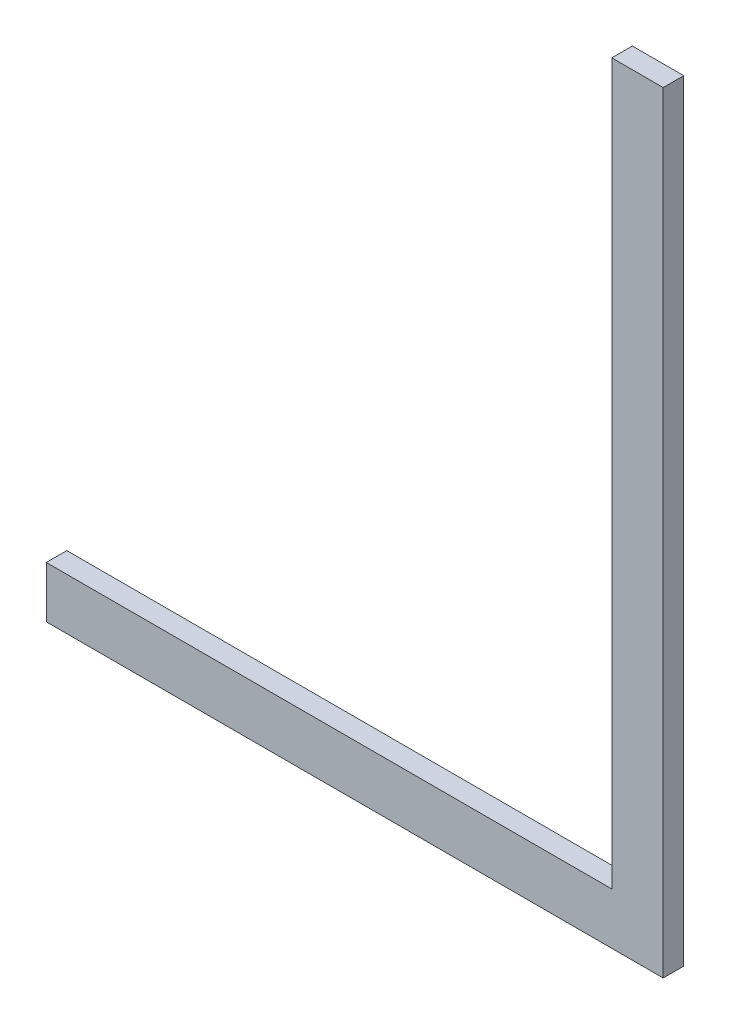
ISO-10303-21;
HEADER;
FILE_DESCRIPTION(('STEP AP214'),'2;1');
FILE_NAME('part.step','',(''),(''),'','','');
FILE_SCHEMA(('AUTOMOTIVE_DESIGN { 1 0 10303 214 1 1 1 1 }'));
ENDSEC;
DATA;
#1=APPLICATION_CONTEXT('core data for automotive mechanical design processes');
#2=APPLICATION_PROTOCOL_DEFINITION('international standard','automotive_design',2000,#1);
#3=PRODUCT_CONTEXT('',#1,'mechanical');
#4=PRODUCT('Part','Part','',(#3));
#5=PRODUCT_RELATED_PRODUCT_CATEGORY('part','',(#4));
#6=PRODUCT_DEFINITION_FORMATION('','',#4);
#7=PRODUCT_DEFINITION_CONTEXT('part definition',#1,'design');
#8=PRODUCT_DEFINITION('design','',#6,#7);
#9=PRODUCT_DEFINITION_SHAPE('','',#8);
#10=(LENGTH_UNIT() NAMED_UNIT(*) SI_UNIT(.MILLI.,.METRE.));
#11=(NAMED_UNIT(*) PLANE_ANGLE_UNIT() SI_UNIT($,.RADIAN.));
#12=(NAMED_UNIT(*) SI_UNIT($,.STERADIAN.) SOLID_ANGLE_UNIT());
#13=UNCERTAINTY_MEASURE_WITH_UNIT(LENGTH_MEASURE(1.E-05),#10,'distance_accuracy_value','');
#14=(GEOMETRIC_REPRESENTATION_CONTEXT(3) GLOBAL_UNCERTAINTY_ASSIGNED_CONTEXT((#13)) GLOBAL_UNIT_ASSIGNED_CONTEXT((#10,
#11,#12)) REPRESENTATION_CONTEXT('',''));
#15=CARTESIAN_POINT('',(0.,0.,0.));
#16=DIRECTION('',(0.,0.,1.));
#17=DIRECTION('',(1.,0.,0.));
#18=AXIS2_PLACEMENT_3D('',#15,#16,#17);
#19=CARTESIAN_POINT('',(-5.87837837837839,145.456081081081,4.));
#20=DIRECTION('',(1.,0.,0.));
#21=DIRECTION('',(0.,1.,0.));
#22=AXIS2_PLACEMENT_3D('',#19,#20,#21);
#23=PLANE('',#22);
#24=DIRECTION('',(0.,-1.,0.));
#25=VECTOR('',#24,1.);
#26=CARTESIAN_POINT('',(-5.87837837837839,145.456081081081,0.));
#27=LINE('',#26,#25);
#28=CARTESIAN_POINT('',(-5.87837837837839,145.456081081081,0.));
#29=VERTEX_POINT('',#28);
#30=CARTESIAN_POINT('',(-5.8783783783784,5.45608108108106,0.));
#31=VERTEX_POINT('',#30);
#32=EDGE_CURVE('E118',#29,#31,#27,.T.);
#33=ORIENTED_EDGE('',*,*,#32,.T.);
#34=DIRECTION('',(0.,0.,1.));
#35=VECTOR('',#34,1.);
#36=CARTESIAN_POINT('',(-5.8783783783784,5.45608108108106,0.));
#37=LINE('',#36,#35);
#38=CARTESIAN_POINT('',(-5.87837837837838,5.45608108108106,4.));
#39=VERTEX_POINT('',#38);
#40=EDGE_CURVE('E103',#31,#39,#37,.T.);
#41=ORIENTED_EDGE('',*,*,#40,.T.);
#42=DIRECTION('',(0.,-1.,0.));
#43=VECTOR('',#42,1.);
#44=CARTESIAN_POINT('',(-5.87837837837839,145.456081081081,4.));
#45=LINE('',#44,#43);
#46=CARTESIAN_POINT('',(-5.87837837837839,145.456081081081,4.));
#47=VERTEX_POINT('',#46);
#48=EDGE_CURVE('E141',#47,#39,#45,.T.);
#49=ORIENTED_EDGE('',*,*,#48,.F.);
#50=DIRECTION('',(0.,0.,-1.));
#51=VECTOR('',#50,1.);
#52=CARTESIAN_POINT('',(-5.87837837837839,145.456081081081,4.));
#53=LINE('',#52,#51);
#54=EDGE_CURVE('E123',#47,#29,#53,.T.);
#55=ORIENTED_EDGE('',*,*,#54,.T.);
#56=EDGE_LOOP('',(#33,#41,#49,#55));
#57=FACE_BOUND('',#56,.T.);
#58=ADVANCED_FACE('F43',(#57),#23,.F.);
#59=CARTESIAN_POINT('',(4.12162162162163,-4.54391891891892,4.));
#60=DIRECTION('',(0.,1.,0.));
#61=DIRECTION('',(-1.,0.,0.));
#62=AXIS2_PLACEMENT_3D('',#59,#60,#61);
#63=PLANE('',#62);
#64=DIRECTION('',(1.,0.,0.));
#65=VECTOR('',#64,1.);
#66=CARTESIAN_POINT('',(4.12162162162163,-4.54391891891892,0.));
#67=LINE('',#66,#65);
#68=CARTESIAN_POINT('',(-115.878378378378,-4.54391891891893,0.));
#69=VERTEX_POINT('',#68);
#70=CARTESIAN_POINT('',(4.12162162162163,-4.54391891891892,0.));
#71=VERTEX_POINT('',#70);
#72=EDGE_CURVE('E125',#69,#71,#67,.T.);
#73=ORIENTED_EDGE('',*,*,#72,.T.);
#74=DIRECTION('',(0.,0.,-1.));
#75=VECTOR('',#74,1.);
#76=CARTESIAN_POINT('',(4.12162162162163,-4.54391891891892,4.));
#77=LINE('',#76,#75);
#78=CARTESIAN_POINT('',(4.12162162162163,-4.54391891891892,4.));
#79=VERTEX_POINT('',#78);
#80=EDGE_CURVE('E11',#79,#71,#77,.T.);
#81=ORIENTED_EDGE('',*,*,#80,.F.);
#82=DIRECTION('',(1.,0.,0.));
#83=VECTOR('',#82,1.);
#84=CARTESIAN_POINT('',(4.12162162162163,-4.54391891891892,4.));
#85=LINE('',#84,#83);
#86=CARTESIAN_POINT('',(-115.878378378378,-4.54391891891893,4.));
#87=VERTEX_POINT('',#86);
#88=EDGE_CURVE('E89',#87,#79,#85,.T.);
#89=ORIENTED_EDGE('',*,*,#88,.F.);
#90=DIRECTION('',(0.,0.,1.));
#91=VECTOR('',#90,1.);
#92=CARTESIAN_POINT('',(-115.878378378378,-4.54391891891893,0.));
#93=LINE('',#92,#91);
#94=EDGE_CURVE('E126',#69,#87,#93,.T.);
#95=ORIENTED_EDGE('',*,*,#94,.F.);
#96=EDGE_LOOP('',(#73,#81,#89,#95));
#97=FACE_BOUND('',#96,.T.);
#98=ADVANCED_FACE('F153',(#97),#63,.F.);
#99=CARTESIAN_POINT('',(4.12162162162161,145.456081081081,4.));
#100=DIRECTION('',(-1.,0.,0.));
#101=DIRECTION('',(0.,-1.,0.));
#102=AXIS2_PLACEMENT_3D('',#99,#100,#101);
#103=PLANE('',#102);
#104=DIRECTION('',(0.,1.,0.));
#105=VECTOR('',#104,1.);
#106=CARTESIAN_POINT('',(4.12162162162161,145.456081081081,0.));
#107=LINE('',#106,#105);
#108=CARTESIAN_POINT('',(4.12162162162161,145.456081081081,0.));
#109=VERTEX_POINT('',#108);
#110=EDGE_CURVE('E130',#71,#109,#107,.T.);
#111=ORIENTED_EDGE('',*,*,#110,.T.);
#112=DIRECTION('',(0.,0.,-1.));
#113=VECTOR('',#112,1.);
#114=CARTESIAN_POINT('',(4.12162162162161,145.456081081081,4.));
#115=LINE('',#114,#113);
#116=CARTESIAN_POINT('',(4.12162162162161,145.456081081081,4.));
#117=VERTEX_POINT('',#116);
#118=EDGE_CURVE('E51',#117,#109,#115,.T.);
#119=ORIENTED_EDGE('',*,*,#118,.F.);
#120=DIRECTION('',(0.,1.,0.));
#121=VECTOR('',#120,1.);
#122=CARTESIAN_POINT('',(4.12162162162161,145.456081081081,4.));
#123=LINE('',#122,#121);
#124=EDGE_CURVE('E151',#79,#117,#123,.T.);
#125=ORIENTED_EDGE('',*,*,#124,.F.);
#126=ORIENTED_EDGE('',*,*,#80,.T.);
#127=EDGE_LOOP('',(#111,#119,#125,#126));
#128=FACE_BOUND('',#127,.T.);
#129=ADVANCED_FACE('F150',(#128),#103,.F.);
#130=CARTESIAN_POINT('',(4.12162162162161,145.456081081081,4.));
#131=DIRECTION('',(0.,-1.,0.));
#132=DIRECTION('',(0.,0.,-1.));
#133=AXIS2_PLACEMENT_3D('',#130,#131,#132);
#134=PLANE('',#133);
#135=DIRECTION('',(-1.,0.,0.));
#136=VECTOR('',#135,1.);
#137=CARTESIAN_POINT('',(4.12162162162161,145.456081081081,0.));
#138=LINE('',#137,#136);
#139=EDGE_CURVE('E84',#109,#29,#138,.T.);
#140=ORIENTED_EDGE('',*,*,#139,.T.);
#141=ORIENTED_EDGE('',*,*,#54,.F.);
#142=DIRECTION('',(-1.,0.,0.));
#143=VECTOR('',#142,1.);
#144=CARTESIAN_POINT('',(4.12162162162161,145.456081081081,4.));
#145=LINE('',#144,#143);
#146=EDGE_CURVE('E67',#117,#47,#145,.T.);
#147=ORIENTED_EDGE('',*,*,#146,.F.);
#148=ORIENTED_EDGE('',*,*,#118,.T.);
#149=EDGE_LOOP('',(#140,#141,#147,#148));
#150=FACE_BOUND('',#149,.T.);
#151=ADVANCED_FACE('F145',(#150),#134,.F.);
#152=CARTESIAN_POINT('',(0.,0.,4.));
#153=DIRECTION('',(0.,0.,-1.));
#154=DIRECTION('',(-1.,0.,0.));
#155=AXIS2_PLACEMENT_3D('',#152,#153,#154);
#156=PLANE('',#155);
#157=ORIENTED_EDGE('',*,*,#48,.T.);
#158=DIRECTION('',(-1.,0.,0.));
#159=VECTOR('',#158,1.);
#160=CARTESIAN_POINT('',(-115.878378378378,5.45608108108107,4.));
#161=LINE('',#160,#159);
#162=CARTESIAN_POINT('',(-115.878378378378,5.45608108108107,4.));
#163=VERTEX_POINT('',#162);
#164=EDGE_CURVE('E58',#39,#163,#161,.T.);
#165=ORIENTED_EDGE('',*,*,#164,.T.);
#166=DIRECTION('',(0.,-1.,0.));
#167=VECTOR('',#166,1.);
#168=CARTESIAN_POINT('',(-115.878378378378,-4.54391891891893,4.));
#169=LINE('',#168,#167);
#170=EDGE_CURVE('E121',#163,#87,#169,.T.);
#171=ORIENTED_EDGE('',*,*,#170,.T.);
#172=ORIENTED_EDGE('',*,*,#88,.T.);
#173=ORIENTED_EDGE('',*,*,#124,.T.);
#174=ORIENTED_EDGE('',*,*,#146,.T.);
#175=EDGE_LOOP('',(#157,#165,#171,#172,#173,#174));
#176=FACE_BOUND('',#175,.T.);
#177=ADVANCED_FACE('F173',(#176),#156,.F.);
#178=CARTESIAN_POINT('',(0.,0.,0.));
#179=DIRECTION('',(0.,0.,-1.));
#180=DIRECTION('',(-1.,0.,0.));
#181=AXIS2_PLACEMENT_3D('',#178,#179,#180);
#182=PLANE('',#181);
#183=CARTESIAN_POINT('',(-0.878378378378394,135.456081081081,0.));
#184=DIRECTION('',(0.,0.,-1.));
#185=DIRECTION('',(-1.,0.,0.));
#186=AXIS2_PLACEMENT_3D('',#183,#184,#185);
#187=CIRCLE('',#186,3.);
#188=CARTESIAN_POINT('',(-3.8783783783784,135.456081081081,0.));
#189=VERTEX_POINT('',#188);
#190=EDGE_CURVE('E289',#189,#189,#187,.T.);
#191=ORIENTED_EDGE('',*,*,#190,.F.);
#192=EDGE_LOOP('',(#191));
#193=FACE_BOUND('',#192,.T.);
#194=ORIENTED_EDGE('',*,*,#32,.F.);
#195=ORIENTED_EDGE('',*,*,#139,.F.);
#196=ORIENTED_EDGE('',*,*,#110,.F.);
#197=ORIENTED_EDGE('',*,*,#72,.F.);
#198=DIRECTION('',(0.,-1.,0.));
#199=VECTOR('',#198,1.);
#200=CARTESIAN_POINT('',(-115.878378378378,-4.54391891891893,0.));
#201=LINE('',#200,#199);
#202=CARTESIAN_POINT('',(-115.878378378378,5.45608108108107,0.));
#203=VERTEX_POINT('',#202);
#204=EDGE_CURVE('E112',#203,#69,#201,.T.);
#205=ORIENTED_EDGE('',*,*,#204,.F.);
#206=DIRECTION('',(-1.,0.,0.));
#207=VECTOR('',#206,1.);
#208=CARTESIAN_POINT('',(-115.878378378378,5.45608108108107,0.));
#209=LINE('',#208,#207);
#210=EDGE_CURVE('E106',#31,#203,#209,.T.);
#211=ORIENTED_EDGE('',*,*,#210,.F.);
#212=EDGE_LOOP('',(#194,#195,#196,#197,#205,#211));
#213=FACE_BOUND('',#212,.T.);
#214=ADVANCED_FACE('F117',(#193,#213),#182,.T.);
#215=CARTESIAN_POINT('',(-115.878378378378,-4.54391891891893,0.));
#216=DIRECTION('',(-1.,0.,0.));
#217=DIRECTION('',(0.,0.,1.));
#218=AXIS2_PLACEMENT_3D('',#215,#216,#217);
#219=PLANE('',#218);
#220=ORIENTED_EDGE('',*,*,#170,.F.);
#221=DIRECTION('',(0.,0.,1.));
#222=VECTOR('',#221,1.);
#223=CARTESIAN_POINT('',(-115.878378378378,5.45608108108107,0.));
#224=LINE('',#223,#222);
#225=EDGE_CURVE('E111',#203,#163,#224,.T.);
#226=ORIENTED_EDGE('',*,*,#225,.F.);
#227=ORIENTED_EDGE('',*,*,#204,.T.);
#228=ORIENTED_EDGE('',*,*,#94,.T.);
#229=EDGE_LOOP('',(#220,#226,#227,#228));
#230=FACE_BOUND('',#229,.T.);
#231=ADVANCED_FACE('F156',(#230),#219,.T.);
#232=CARTESIAN_POINT('',(-115.878378378378,5.45608108108107,0.));
#233=DIRECTION('',(0.,1.,0.));
#234=DIRECTION('',(-1.,0.,0.));
#235=AXIS2_PLACEMENT_3D('',#232,#233,#234);
#236=PLANE('',#235);
#237=ORIENTED_EDGE('',*,*,#164,.F.);
#238=ORIENTED_EDGE('',*,*,#40,.F.);
#239=ORIENTED_EDGE('',*,*,#210,.T.);
#240=ORIENTED_EDGE('',*,*,#225,.T.);
#241=EDGE_LOOP('',(#237,#238,#239,#240));
#242=FACE_BOUND('',#241,.T.);
#243=ADVANCED_FACE('F105',(#242),#236,.T.);
#244=CARTESIAN_POINT('',(-0.878378378378394,135.456081081081,-1.));
#245=DIRECTION('',(0.,0.,1.));
#246=DIRECTION('',(1.,0.,0.));
#247=AXIS2_PLACEMENT_3D('',#244,#245,#246);
#248=CYLINDRICAL_SURFACE('',#247,3.);
#249=CARTESIAN_POINT('',(-0.878378378378394,135.456081081081,-1.));
#250=DIRECTION('',(0.,0.,-1.));
#251=DIRECTION('',(-1.,0.,0.));
#252=AXIS2_PLACEMENT_3D('',#249,#250,#251);
#253=CIRCLE('',#252,3.);
#254=CARTESIAN_POINT('',(-3.8783783783784,135.456081081081,-1.));
#255=VERTEX_POINT('',#254);
#256=EDGE_CURVE('E163',#255,#255,#253,.T.);
#257=ORIENTED_EDGE('',*,*,#256,.F.);
#258=EDGE_LOOP('',(#257));
#259=FACE_BOUND('',#258,.T.);
#260=ORIENTED_EDGE('',*,*,#190,.T.);
#261=EDGE_LOOP('',(#260));
#262=FACE_BOUND('',#261,.T.);
#263=ADVANCED_FACE('F234',(#259,#262),#248,.T.);
#264=CARTESIAN_POINT('',(-0.878378378378394,135.456081081081,-1.));
#265=DIRECTION('',(0.,0.,-1.));
#266=DIRECTION('',(-1.,0.,0.));
#267=AXIS2_PLACEMENT_3D('',#264,#265,#266);
#268=PLANE('',#267);
#269=ORIENTED_EDGE('',*,*,#256,.T.);
#270=EDGE_LOOP('',(#269));
#271=FACE_BOUND('',#270,.T.);
#272=ADVANCED_FACE('F248',(#271),#268,.T.);
#273=CLOSED_SHELL('',(#58,#98,#129,#151,#177,#214,#231,#243,#263,#272));
#274=MANIFOLD_SOLID_BREP('B2',#273);
#275=ADVANCED_BREP_SHAPE_REPRESENTATION('',(#18,#274),#14);
#276=SHAPE_DEFINITION_REPRESENTATION(#9,#275);
ENDSEC;
END-ISO-10303-21;
